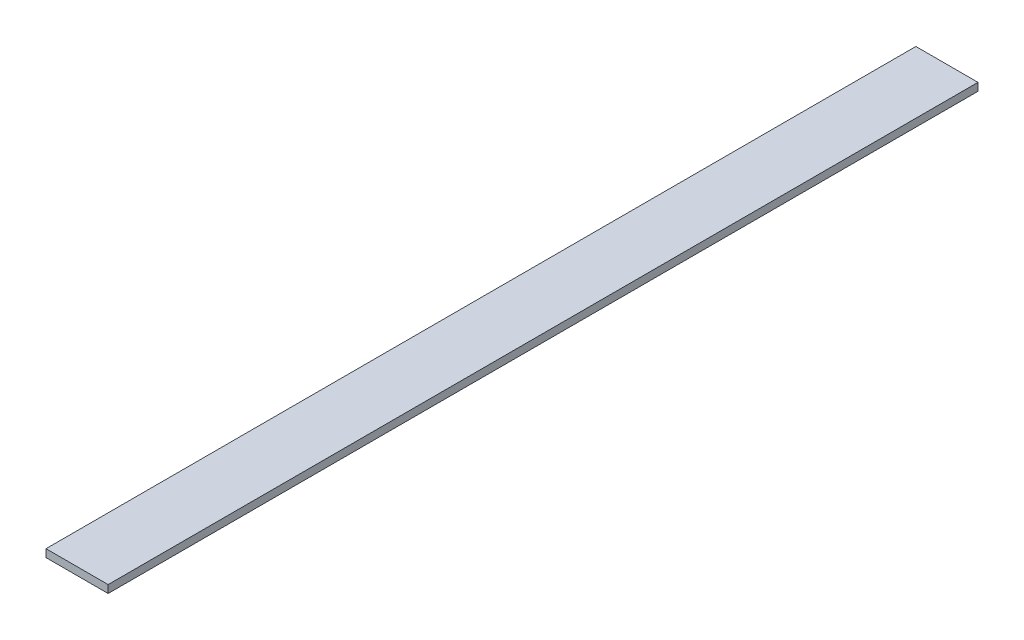
ISO-10303-21;
HEADER;
FILE_DESCRIPTION(('STEP AP214'),'2;1');
FILE_NAME('part.step','',(''),(''),'','','');
FILE_SCHEMA(('AUTOMOTIVE_DESIGN { 1 0 10303 214 1 1 1 1 }'));
ENDSEC;
DATA;
#1=APPLICATION_CONTEXT('core data for automotive mechanical design processes');
#2=APPLICATION_PROTOCOL_DEFINITION('international standard','automotive_design',2000,#1);
#3=PRODUCT_CONTEXT('',#1,'mechanical');
#4=PRODUCT('Part','Part','',(#3));
#5=PRODUCT_RELATED_PRODUCT_CATEGORY('part','',(#4));
#6=PRODUCT_DEFINITION_FORMATION('','',#4);
#7=PRODUCT_DEFINITION_CONTEXT('part definition',#1,'design');
#8=PRODUCT_DEFINITION('design','',#6,#7);
#9=PRODUCT_DEFINITION_SHAPE('','',#8);
#10=(LENGTH_UNIT() NAMED_UNIT(*) SI_UNIT(.MILLI.,.METRE.));
#11=(NAMED_UNIT(*) PLANE_ANGLE_UNIT() SI_UNIT($,.RADIAN.));
#12=(NAMED_UNIT(*) SI_UNIT($,.STERADIAN.) SOLID_ANGLE_UNIT());
#13=UNCERTAINTY_MEASURE_WITH_UNIT(LENGTH_MEASURE(1.E-05),#10,'distance_accuracy_value','');
#14=(GEOMETRIC_REPRESENTATION_CONTEXT(3) GLOBAL_UNCERTAINTY_ASSIGNED_CONTEXT((#13)) GLOBAL_UNIT_ASSIGNED_CONTEXT((#10,
#11,#12)) REPRESENTATION_CONTEXT('',''));
#15=CARTESIAN_POINT('',(0.,0.,0.));
#16=DIRECTION('',(0.,0.,1.));
#17=DIRECTION('',(1.,0.,0.));
#18=AXIS2_PLACEMENT_3D('',#15,#16,#17);
#19=CARTESIAN_POINT('',(0.,0.,0.));
#20=DIRECTION('',(0.,1.,0.));
#21=DIRECTION('',(0.,0.,1.));
#22=AXIS2_PLACEMENT_3D('',#19,#20,#21);
#23=PLANE('',#22);
#24=DIRECTION('',(0.,0.,-1.));
#25=VECTOR('',#24,1.);
#26=CARTESIAN_POINT('',(25.4,0.,355.6));
#27=LINE('',#26,#25);
#28=CARTESIAN_POINT('',(25.4,0.,355.6));
#29=VERTEX_POINT('',#28);
#30=CARTESIAN_POINT('',(25.4,0.,-355.6));
#31=VERTEX_POINT('',#30);
#32=EDGE_CURVE('E20',#29,#31,#27,.T.);
#33=ORIENTED_EDGE('',*,*,#32,.F.);
#34=DIRECTION('',(1.,0.,0.));
#35=VECTOR('',#34,1.);
#36=CARTESIAN_POINT('',(-25.4,0.,355.6));
#37=LINE('',#36,#35);
#38=CARTESIAN_POINT('',(-25.4,0.,355.6));
#39=VERTEX_POINT('',#38);
#40=EDGE_CURVE('E80',#39,#29,#37,.T.);
#41=ORIENTED_EDGE('',*,*,#40,.F.);
#42=DIRECTION('',(0.,0.,1.));
#43=VECTOR('',#42,1.);
#44=CARTESIAN_POINT('',(-25.4,0.,-355.6));
#45=LINE('',#44,#43);
#46=CARTESIAN_POINT('',(-25.4,0.,-355.6));
#47=VERTEX_POINT('',#46);
#48=EDGE_CURVE('E68',#47,#39,#45,.T.);
#49=ORIENTED_EDGE('',*,*,#48,.F.);
#50=DIRECTION('',(-1.,0.,0.));
#51=VECTOR('',#50,1.);
#52=CARTESIAN_POINT('',(25.4,0.,-355.6));
#53=LINE('',#52,#51);
#54=EDGE_CURVE('E55',#31,#47,#53,.T.);
#55=ORIENTED_EDGE('',*,*,#54,.F.);
#56=EDGE_LOOP('',(#33,#41,#49,#55));
#57=FACE_BOUND('',#56,.T.);
#58=ADVANCED_FACE('F17',(#57),#23,.F.);
#59=CARTESIAN_POINT('',(25.4,0.,355.6));
#60=DIRECTION('',(1.,0.,0.));
#61=DIRECTION('',(0.,0.,-1.));
#62=AXIS2_PLACEMENT_3D('',#59,#60,#61);
#63=PLANE('',#62);
#64=ORIENTED_EDGE('',*,*,#32,.T.);
#65=DIRECTION('',(0.,1.,0.));
#66=VECTOR('',#65,1.);
#67=CARTESIAN_POINT('',(25.4,0.,-355.6));
#68=LINE('',#67,#66);
#69=CARTESIAN_POINT('',(25.4,6.35,-355.6));
#70=VERTEX_POINT('',#69);
#71=EDGE_CURVE('E61',#70,#31,#68,.F.);
#72=ORIENTED_EDGE('',*,*,#71,.F.);
#73=DIRECTION('',(0.,0.,1.));
#74=VECTOR('',#73,1.);
#75=CARTESIAN_POINT('',(25.4,6.35,0.));
#76=LINE('',#75,#74);
#77=CARTESIAN_POINT('',(25.4,6.35,355.6));
#78=VERTEX_POINT('',#77);
#79=EDGE_CURVE('E83',#78,#70,#76,.F.);
#80=ORIENTED_EDGE('',*,*,#79,.F.);
#81=DIRECTION('',(0.,1.,0.));
#82=VECTOR('',#81,1.);
#83=CARTESIAN_POINT('',(25.4,0.,355.6));
#84=LINE('',#83,#82);
#85=EDGE_CURVE('E64',#29,#78,#84,.T.);
#86=ORIENTED_EDGE('',*,*,#85,.F.);
#87=EDGE_LOOP('',(#64,#72,#80,#86));
#88=FACE_BOUND('',#87,.T.);
#89=ADVANCED_FACE('F60',(#88),#63,.T.);
#90=CARTESIAN_POINT('',(25.4,0.,-355.6));
#91=DIRECTION('',(0.,0.,-1.));
#92=DIRECTION('',(-1.,0.,0.));
#93=AXIS2_PLACEMENT_3D('',#90,#91,#92);
#94=PLANE('',#93);
#95=ORIENTED_EDGE('',*,*,#54,.T.);
#96=DIRECTION('',(0.,1.,0.));
#97=VECTOR('',#96,1.);
#98=CARTESIAN_POINT('',(-25.4,0.,-355.6));
#99=LINE('',#98,#97);
#100=CARTESIAN_POINT('',(-25.4,6.35,-355.6));
#101=VERTEX_POINT('',#100);
#102=EDGE_CURVE('E70',#101,#47,#99,.F.);
#103=ORIENTED_EDGE('',*,*,#102,.F.);
#104=DIRECTION('',(1.,0.,0.));
#105=VECTOR('',#104,1.);
#106=CARTESIAN_POINT('',(0.,6.35,-355.6));
#107=LINE('',#106,#105);
#108=EDGE_CURVE('E74',#70,#101,#107,.F.);
#109=ORIENTED_EDGE('',*,*,#108,.F.);
#110=ORIENTED_EDGE('',*,*,#71,.T.);
#111=EDGE_LOOP('',(#95,#103,#109,#110));
#112=FACE_BOUND('',#111,.T.);
#113=ADVANCED_FACE('F72',(#112),#94,.T.);
#114=CARTESIAN_POINT('',(-25.4,0.,-355.6));
#115=DIRECTION('',(-1.,0.,0.));
#116=DIRECTION('',(0.,0.,1.));
#117=AXIS2_PLACEMENT_3D('',#114,#115,#116);
#118=PLANE('',#117);
#119=ORIENTED_EDGE('',*,*,#48,.T.);
#120=DIRECTION('',(0.,1.,0.));
#121=VECTOR('',#120,1.);
#122=CARTESIAN_POINT('',(-25.4,0.,355.6));
#123=LINE('',#122,#121);
#124=CARTESIAN_POINT('',(-25.4,6.35,355.6));
#125=VERTEX_POINT('',#124);
#126=EDGE_CURVE('E35',#125,#39,#123,.F.);
#127=ORIENTED_EDGE('',*,*,#126,.F.);
#128=DIRECTION('',(0.,0.,1.));
#129=VECTOR('',#128,1.);
#130=CARTESIAN_POINT('',(-25.4,6.35,0.));
#131=LINE('',#130,#129);
#132=EDGE_CURVE('E26',#101,#125,#131,.T.);
#133=ORIENTED_EDGE('',*,*,#132,.F.);
#134=ORIENTED_EDGE('',*,*,#102,.T.);
#135=EDGE_LOOP('',(#119,#127,#133,#134));
#136=FACE_BOUND('',#135,.T.);
#137=ADVANCED_FACE('F89',(#136),#118,.T.);
#138=CARTESIAN_POINT('',(-25.4,0.,355.6));
#139=DIRECTION('',(0.,0.,1.));
#140=DIRECTION('',(1.,0.,0.));
#141=AXIS2_PLACEMENT_3D('',#138,#139,#140);
#142=PLANE('',#141);
#143=ORIENTED_EDGE('',*,*,#40,.T.);
#144=ORIENTED_EDGE('',*,*,#85,.T.);
#145=DIRECTION('',(1.,0.,0.));
#146=VECTOR('',#145,1.);
#147=CARTESIAN_POINT('',(0.,6.35,355.6));
#148=LINE('',#147,#146);
#149=EDGE_CURVE('E11',#125,#78,#148,.T.);
#150=ORIENTED_EDGE('',*,*,#149,.F.);
#151=ORIENTED_EDGE('',*,*,#126,.T.);
#152=EDGE_LOOP('',(#143,#144,#150,#151));
#153=FACE_BOUND('',#152,.T.);
#154=ADVANCED_FACE('F91',(#153),#142,.T.);
#155=CARTESIAN_POINT('',(0.,6.35,0.));
#156=DIRECTION('',(0.,1.,0.));
#157=DIRECTION('',(0.,0.,1.));
#158=AXIS2_PLACEMENT_3D('',#155,#156,#157);
#159=PLANE('',#158);
#160=ORIENTED_EDGE('',*,*,#132,.T.);
#161=ORIENTED_EDGE('',*,*,#149,.T.);
#162=ORIENTED_EDGE('',*,*,#79,.T.);
#163=ORIENTED_EDGE('',*,*,#108,.T.);
#164=EDGE_LOOP('',(#160,#161,#162,#163));
#165=FACE_BOUND('',#164,.T.);
#166=ADVANCED_FACE('F88',(#165),#159,.T.);
#167=CLOSED_SHELL('',(#58,#89,#113,#137,#154,#166));
#168=MANIFOLD_SOLID_BREP('B1',#167);
#169=ADVANCED_BREP_SHAPE_REPRESENTATION('',(#18,#168),#14);
#170=SHAPE_DEFINITION_REPRESENTATION(#9,#169);
ENDSEC;
END-ISO-10303-21;
